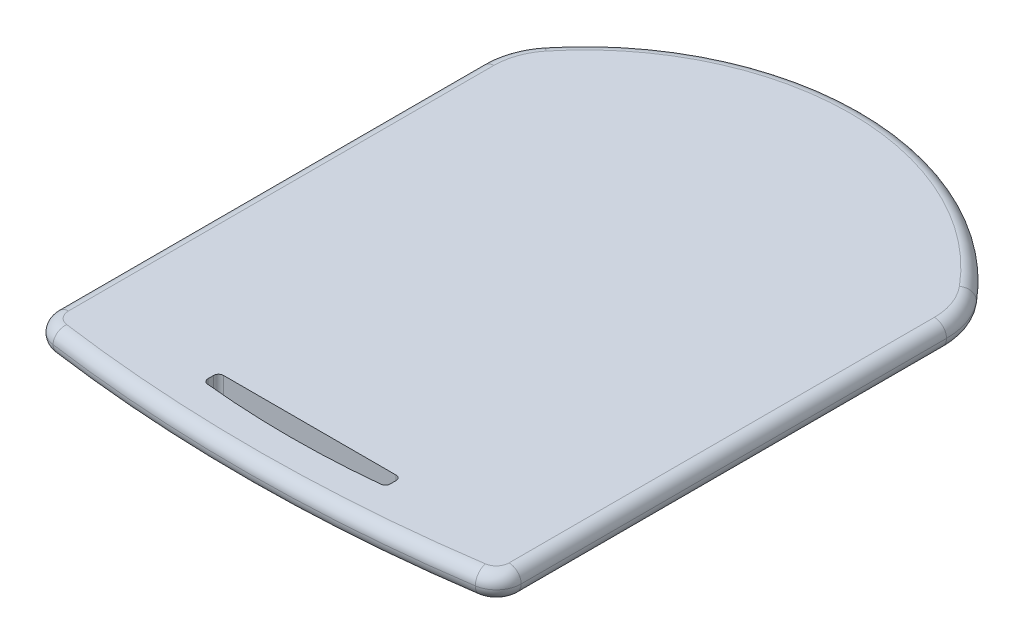
ISO-10303-21;
HEADER;
FILE_DESCRIPTION(('STEP AP214'),'2;1');
FILE_NAME('part.step','',(''),(''),'','','');
FILE_SCHEMA(('AUTOMOTIVE_DESIGN { 1 0 10303 214 1 1 1 1 }'));
ENDSEC;
DATA;
#1=APPLICATION_CONTEXT('core data for automotive mechanical design processes');
#2=APPLICATION_PROTOCOL_DEFINITION('international standard','automotive_design',2000,#1);
#3=PRODUCT_CONTEXT('',#1,'mechanical');
#4=PRODUCT('Part','Part','',(#3));
#5=PRODUCT_RELATED_PRODUCT_CATEGORY('part','',(#4));
#6=PRODUCT_DEFINITION_FORMATION('','',#4);
#7=PRODUCT_DEFINITION_CONTEXT('part definition',#1,'design');
#8=PRODUCT_DEFINITION('design','',#6,#7);
#9=PRODUCT_DEFINITION_SHAPE('','',#8);
#10=(LENGTH_UNIT() NAMED_UNIT(*) SI_UNIT(.MILLI.,.METRE.));
#11=(NAMED_UNIT(*) PLANE_ANGLE_UNIT() SI_UNIT($,.RADIAN.));
#12=(NAMED_UNIT(*) SI_UNIT($,.STERADIAN.) SOLID_ANGLE_UNIT());
#13=UNCERTAINTY_MEASURE_WITH_UNIT(LENGTH_MEASURE(1.E-05),#10,'distance_accuracy_value','');
#14=(GEOMETRIC_REPRESENTATION_CONTEXT(3) GLOBAL_UNCERTAINTY_ASSIGNED_CONTEXT((#13)) GLOBAL_UNIT_ASSIGNED_CONTEXT((#10,
#11,#12)) REPRESENTATION_CONTEXT('',''));
#15=CARTESIAN_POINT('',(0.,0.,0.));
#16=DIRECTION('',(0.,0.,1.));
#17=DIRECTION('',(1.,0.,0.));
#18=AXIS2_PLACEMENT_3D('',#15,#16,#17);
#19=CARTESIAN_POINT('',(84.8196952527564,10.,66.8932222649289));
#20=DIRECTION('',(0.,1.,0.));
#21=DIRECTION('',(0.,0.,1.));
#22=AXIS2_PLACEMENT_3D('',#19,#20,#21);
#23=PLANE('',#22);
#24=CARTESIAN_POINT('',(-3.23182190351051,10.,-527.331403190441));
#25=DIRECTION('',(0.,1.,0.));
#26=DIRECTION('',(0.,0.,1.));
#27=AXIS2_PLACEMENT_3D('',#24,#25,#26);
#28=CIRCLE('',#27,605.957669560178);
#29=CARTESIAN_POINT('',(-85.7928455469745,10.,72.9754972144648));
#30=VERTEX_POINT('',#29);
#31=CARTESIAN_POINT('',(85.5884666276943,10.,72.0813541346221));
#32=VERTEX_POINT('',#31);
#33=EDGE_CURVE('E252',#30,#32,#28,.T.);
#34=ORIENTED_EDGE('',*,*,#33,.T.);
#35=CARTESIAN_POINT('',(84.8196952527564,10.,66.8932222649289));
#36=DIRECTION('',(0.,1.,0.));
#37=DIRECTION('',(0.,0.,1.));
#38=AXIS2_PLACEMENT_3D('',#35,#36,#37);
#39=CIRCLE('',#38,5.24478042669569);
#40=CARTESIAN_POINT('',(90.064475679452,10.,66.8932224174004));
#41=VERTEX_POINT('',#40);
#42=EDGE_CURVE('E254',#32,#41,#39,.T.);
#43=ORIENTED_EDGE('',*,*,#42,.T.);
#44=DIRECTION('',(2.90710929138983E-08,0.,-1.));
#45=VECTOR('',#44,1.);
#46=CARTESIAN_POINT('',(90.0644807668933,10.,-108.1067775826));
#47=LINE('',#46,#45);
#48=CARTESIAN_POINT('',(90.0644807668933,10.,-108.1067775826));
#49=VERTEX_POINT('',#48);
#50=EDGE_CURVE('E240',#41,#49,#47,.T.);
#51=ORIENTED_EDGE('',*,*,#50,.T.);
#52=CARTESIAN_POINT('',(64.8496108397123,10.,-108.106778315624));
#53=DIRECTION('',(0.,1.,0.));
#54=DIRECTION('',(0.,0.,1.));
#55=AXIS2_PLACEMENT_3D('',#52,#53,#54);
#56=CIRCLE('',#55,25.214869927181);
#57=CARTESIAN_POINT('',(84.2043618560106,10.,-124.267944070041));
#58=VERTEX_POINT('',#57);
#59=EDGE_CURVE('E242',#49,#58,#56,.T.);
#60=ORIENTED_EDGE('',*,*,#59,.T.);
#61=CARTESIAN_POINT('',(0.235631741272779,10.,-54.1542771760837));
#62=DIRECTION('',(0.,1.,0.));
#63=DIRECTION('',(0.,0.,1.));
#64=AXIS2_PLACEMENT_3D('',#61,#62,#63);
#65=CIRCLE('',#64,109.392293706634);
#66=CARTESIAN_POINT('',(-84.681676564494,10.,-123.116039570195));
#67=VERTEX_POINT('',#66);
#68=EDGE_CURVE('E244',#58,#67,#65,.T.);
#69=ORIENTED_EDGE('',*,*,#68,.T.);
#70=CARTESIAN_POINT('',(-65.1082787414404,10.,-107.220387236769));
#71=DIRECTION('',(0.,1.,0.));
#72=DIRECTION('',(0.,0.,1.));
#73=AXIS2_PLACEMENT_3D('',#70,#71,#72);
#74=CIRCLE('',#73,25.2148699271814);
#75=CARTESIAN_POINT('',(-90.3231486686161,10.,-107.220370250178));
#76=VERTEX_POINT('',#75);
#77=EDGE_CURVE('E246',#67,#76,#74,.T.);
#78=ORIENTED_EDGE('',*,*,#77,.T.);
#79=DIRECTION('',(6.73673554163479E-07,0.,0.999999999999773));
#80=VECTOR('',#79,1.);
#81=CARTESIAN_POINT('',(-90.3230307757441,10.,67.7796297497826));
#82=LINE('',#81,#80);
#83=CARTESIAN_POINT('',(-90.3230307757441,10.,67.7796297497826));
#84=VERTEX_POINT('',#83);
#85=EDGE_CURVE('E248',#76,#84,#82,.T.);
#86=ORIENTED_EDGE('',*,*,#85,.T.);
#87=CARTESIAN_POINT('',(-85.0782503490483,10.,67.7796262165128));
#88=DIRECTION('',(0.,1.,0.));
#89=DIRECTION('',(0.,0.,1.));
#90=AXIS2_PLACEMENT_3D('',#87,#88,#89);
#91=CIRCLE('',#90,5.24478042669643);
#92=EDGE_CURVE('E250',#84,#30,#91,.T.);
#93=ORIENTED_EDGE('',*,*,#92,.T.);
#94=EDGE_LOOP('',(#34,#43,#51,#60,#69,#78,#86,#93));
#95=FACE_BOUND('',#94,.T.);
#96=DIRECTION('',(-1.,0.,0.));
#97=VECTOR('',#96,1.);
#98=CARTESIAN_POINT('',(35.5,10.,58.8214409386156));
#99=LINE('',#98,#97);
#100=CARTESIAN_POINT('',(35.5,10.,58.8214409386156));
#101=VERTEX_POINT('',#100);
#102=CARTESIAN_POINT('',(-35.5,10.,58.8214409386156));
#103=VERTEX_POINT('',#102);
#104=EDGE_CURVE('E591',#101,#103,#99,.T.);
#105=ORIENTED_EDGE('',*,*,#104,.F.);
#106=CARTESIAN_POINT('',(35.5,10.,60.8214409386156));
#107=DIRECTION('',(0.,1.,0.));
#108=DIRECTION('',(0.,0.,-1.));
#109=AXIS2_PLACEMENT_3D('',#106,#107,#108);
#110=CIRCLE('',#109,2.);
#111=CARTESIAN_POINT('',(37.5,10.,60.8214409386156));
#112=VERTEX_POINT('',#111);
#113=EDGE_CURVE('E222',#112,#101,#110,.T.);
#114=ORIENTED_EDGE('',*,*,#113,.F.);
#115=DIRECTION('',(0.,0.,-1.));
#116=VECTOR('',#115,1.);
#117=CARTESIAN_POINT('',(37.5,10.,63.2220084632309));
#118=LINE('',#117,#116);
#119=CARTESIAN_POINT('',(37.5,10.,63.2220084632309));
#120=VERTEX_POINT('',#119);
#121=EDGE_CURVE('E203',#120,#112,#118,.T.);
#122=ORIENTED_EDGE('',*,*,#121,.F.);
#123=CARTESIAN_POINT('',(35.5,10.,63.2220084632309));
#124=DIRECTION('',(0.,1.,0.));
#125=DIRECTION('',(0.,0.,-1.));
#126=AXIS2_PLACEMENT_3D('',#123,#124,#125);
#127=CIRCLE('',#126,2.00000000000001);
#128=CARTESIAN_POINT('',(35.7050934018111,10.,65.2114648453951));
#129=VERTEX_POINT('',#128);
#130=EDGE_CURVE('E585',#129,#120,#127,.T.);
#131=ORIENTED_EDGE('',*,*,#130,.F.);
#132=CARTESIAN_POINT('',(0.,10.,-281.136712700921));
#133=DIRECTION('',(0.,1.,0.));
#134=DIRECTION('',(0.,0.,1.));
#135=AXIS2_PLACEMENT_3D('',#132,#133,#134);
#136=CIRCLE('',#135,348.183735669096);
#137=CARTESIAN_POINT('',(-35.705093401811,10.,65.2114648453951));
#138=VERTEX_POINT('',#137);
#139=EDGE_CURVE('E587',#138,#129,#136,.T.);
#140=ORIENTED_EDGE('',*,*,#139,.F.);
#141=CARTESIAN_POINT('',(-35.5,10.,63.2220084632309));
#142=DIRECTION('',(0.,1.,0.));
#143=DIRECTION('',(0.,0.,1.));
#144=AXIS2_PLACEMENT_3D('',#141,#142,#143);
#145=CIRCLE('',#144,2.00000000000001);
#146=CARTESIAN_POINT('',(-37.5,10.,63.2220084632309));
#147=VERTEX_POINT('',#146);
#148=EDGE_CURVE('E601',#147,#138,#145,.T.);
#149=ORIENTED_EDGE('',*,*,#148,.F.);
#150=DIRECTION('',(0.,0.,1.));
#151=VECTOR('',#150,1.);
#152=CARTESIAN_POINT('',(-37.5,10.,63.2220084632309));
#153=LINE('',#152,#151);
#154=CARTESIAN_POINT('',(-37.5,10.,60.8214409386156));
#155=VERTEX_POINT('',#154);
#156=EDGE_CURVE('E598',#155,#147,#153,.T.);
#157=ORIENTED_EDGE('',*,*,#156,.F.);
#158=CARTESIAN_POINT('',(-35.5,10.,60.8214409386156));
#159=DIRECTION('',(0.,1.,0.));
#160=DIRECTION('',(0.,0.,1.));
#161=AXIS2_PLACEMENT_3D('',#158,#159,#160);
#162=CIRCLE('',#161,2.);
#163=EDGE_CURVE('E593',#103,#155,#162,.T.);
#164=ORIENTED_EDGE('',*,*,#163,.F.);
#165=EDGE_LOOP('',(#105,#114,#122,#131,#140,#149,#157,#164));
#166=FACE_BOUND('',#165,.T.);
#167=ADVANCED_FACE('F35',(#95,#166),#23,.T.);
#168=CARTESIAN_POINT('',(84.8196952527564,0.,66.8932222649289));
#169=DIRECTION('',(0.,1.,0.));
#170=DIRECTION('',(0.,0.,1.));
#171=AXIS2_PLACEMENT_3D('',#168,#169,#170);
#172=PLANE('',#171);
#173=DIRECTION('',(2.90710929138983E-08,0.,-1.));
#174=VECTOR('',#173,1.);
#175=CARTESIAN_POINT('',(90.064475679452,0.,66.8932224174004));
#176=LINE('',#175,#174);
#177=CARTESIAN_POINT('',(90.0644807668933,0.,-108.1067775826));
#178=VERTEX_POINT('',#177);
#179=CARTESIAN_POINT('',(90.064475679452,0.,66.8932224174004));
#180=VERTEX_POINT('',#179);
#181=EDGE_CURVE('E257',#178,#180,#176,.F.);
#182=ORIENTED_EDGE('',*,*,#181,.T.);
#183=CARTESIAN_POINT('',(84.8196952527564,0.,66.8932222649289));
#184=DIRECTION('',(0.,1.,0.));
#185=DIRECTION('',(0.,0.,1.));
#186=AXIS2_PLACEMENT_3D('',#183,#184,#185);
#187=CIRCLE('',#186,5.24478042669569);
#188=CARTESIAN_POINT('',(85.5884666276943,0.,72.0813541346221));
#189=VERTEX_POINT('',#188);
#190=EDGE_CURVE('E11',#180,#189,#187,.F.);
#191=ORIENTED_EDGE('',*,*,#190,.T.);
#192=CARTESIAN_POINT('',(-3.23182190351051,0.,-527.331403190441));
#193=DIRECTION('',(0.,1.,0.));
#194=DIRECTION('',(0.,0.,1.));
#195=AXIS2_PLACEMENT_3D('',#192,#193,#194);
#196=CIRCLE('',#195,605.957669560178);
#197=CARTESIAN_POINT('',(-85.7928455469745,0.,72.9754972144648));
#198=VERTEX_POINT('',#197);
#199=EDGE_CURVE('E45',#189,#198,#196,.F.);
#200=ORIENTED_EDGE('',*,*,#199,.T.);
#201=CARTESIAN_POINT('',(-85.0782503490483,0.,67.7796262165128));
#202=DIRECTION('',(0.,1.,0.));
#203=DIRECTION('',(0.,0.,1.));
#204=AXIS2_PLACEMENT_3D('',#201,#202,#203);
#205=CIRCLE('',#204,5.24478042669643);
#206=CARTESIAN_POINT('',(-90.3230307757441,0.,67.7796297497826));
#207=VERTEX_POINT('',#206);
#208=EDGE_CURVE('E165',#198,#207,#205,.F.);
#209=ORIENTED_EDGE('',*,*,#208,.T.);
#210=DIRECTION('',(6.73673554163479E-07,0.,0.999999999999773));
#211=VECTOR('',#210,1.);
#212=CARTESIAN_POINT('',(-90.3230313728139,0.,66.893340253952));
#213=LINE('',#212,#211);
#214=CARTESIAN_POINT('',(-90.3231486686161,0.,-107.220370250178));
#215=VERTEX_POINT('',#214);
#216=EDGE_CURVE('E169',#207,#215,#213,.F.);
#217=ORIENTED_EDGE('',*,*,#216,.T.);
#218=CARTESIAN_POINT('',(-65.1082787414404,0.,-107.220387236769));
#219=DIRECTION('',(0.,1.,0.));
#220=DIRECTION('',(0.,0.,1.));
#221=AXIS2_PLACEMENT_3D('',#218,#219,#220);
#222=CIRCLE('',#221,25.2148699271814);
#223=CARTESIAN_POINT('',(-84.681676564494,0.,-123.116039570195));
#224=VERTEX_POINT('',#223);
#225=EDGE_CURVE('E179',#215,#224,#222,.F.);
#226=ORIENTED_EDGE('',*,*,#225,.T.);
#227=CARTESIAN_POINT('',(0.235631741272779,0.,-54.1542771760837));
#228=DIRECTION('',(0.,1.,0.));
#229=DIRECTION('',(0.,0.,1.));
#230=AXIS2_PLACEMENT_3D('',#227,#228,#229);
#231=CIRCLE('',#230,109.392293706634);
#232=CARTESIAN_POINT('',(84.2043618560106,0.,-124.267944070041));
#233=VERTEX_POINT('',#232);
#234=EDGE_CURVE('E261',#224,#233,#231,.F.);
#235=ORIENTED_EDGE('',*,*,#234,.T.);
#236=CARTESIAN_POINT('',(64.8496108397123,0.,-108.106778315624));
#237=DIRECTION('',(0.,1.,0.));
#238=DIRECTION('',(0.,0.,1.));
#239=AXIS2_PLACEMENT_3D('',#236,#237,#238);
#240=CIRCLE('',#239,25.214869927181);
#241=EDGE_CURVE('E259',#233,#178,#240,.F.);
#242=ORIENTED_EDGE('',*,*,#241,.T.);
#243=EDGE_LOOP('',(#182,#191,#200,#209,#217,#226,#235,#242));
#244=FACE_BOUND('',#243,.T.);
#245=CARTESIAN_POINT('',(35.5,0.,60.8214409386156));
#246=DIRECTION('',(0.,1.,0.));
#247=DIRECTION('',(0.,0.,-1.));
#248=AXIS2_PLACEMENT_3D('',#245,#246,#247);
#249=CIRCLE('',#248,2.);
#250=CARTESIAN_POINT('',(37.5,0.,60.8214409386156));
#251=VERTEX_POINT('',#250);
#252=CARTESIAN_POINT('',(35.5,0.,58.8214409386156));
#253=VERTEX_POINT('',#252);
#254=EDGE_CURVE('E196',#251,#253,#249,.T.);
#255=ORIENTED_EDGE('',*,*,#254,.T.);
#256=DIRECTION('',(-1.,0.,0.));
#257=VECTOR('',#256,1.);
#258=CARTESIAN_POINT('',(35.5,0.,58.8214409386156));
#259=LINE('',#258,#257);
#260=CARTESIAN_POINT('',(-35.5,0.,58.8214409386156));
#261=VERTEX_POINT('',#260);
#262=EDGE_CURVE('E95',#253,#261,#259,.T.);
#263=ORIENTED_EDGE('',*,*,#262,.T.);
#264=CARTESIAN_POINT('',(-35.5,0.,60.8214409386156));
#265=DIRECTION('',(0.,1.,0.));
#266=DIRECTION('',(0.,0.,1.));
#267=AXIS2_PLACEMENT_3D('',#264,#265,#266);
#268=CIRCLE('',#267,2.);
#269=CARTESIAN_POINT('',(-37.5,0.,60.8214409386156));
#270=VERTEX_POINT('',#269);
#271=EDGE_CURVE('E200',#261,#270,#268,.T.);
#272=ORIENTED_EDGE('',*,*,#271,.T.);
#273=DIRECTION('',(0.,0.,1.));
#274=VECTOR('',#273,1.);
#275=CARTESIAN_POINT('',(-37.5,0.,63.2220084632309));
#276=LINE('',#275,#274);
#277=CARTESIAN_POINT('',(-37.5,0.,63.2220084632309));
#278=VERTEX_POINT('',#277);
#279=EDGE_CURVE('E208',#270,#278,#276,.T.);
#280=ORIENTED_EDGE('',*,*,#279,.T.);
#281=CARTESIAN_POINT('',(-35.5,0.,63.2220084632309));
#282=DIRECTION('',(0.,1.,0.));
#283=DIRECTION('',(0.,0.,1.));
#284=AXIS2_PLACEMENT_3D('',#281,#282,#283);
#285=CIRCLE('',#284,2.00000000000001);
#286=CARTESIAN_POINT('',(-35.705093401811,0.,65.2114648453951));
#287=VERTEX_POINT('',#286);
#288=EDGE_CURVE('E211',#278,#287,#285,.T.);
#289=ORIENTED_EDGE('',*,*,#288,.T.);
#290=CARTESIAN_POINT('',(0.,0.,-281.136712700921));
#291=DIRECTION('',(0.,1.,0.));
#292=DIRECTION('',(0.,0.,1.));
#293=AXIS2_PLACEMENT_3D('',#290,#291,#292);
#294=CIRCLE('',#293,348.183735669096);
#295=CARTESIAN_POINT('',(35.7050934018111,0.,65.2114648453951));
#296=VERTEX_POINT('',#295);
#297=EDGE_CURVE('E214',#287,#296,#294,.T.);
#298=ORIENTED_EDGE('',*,*,#297,.T.);
#299=CARTESIAN_POINT('',(35.5,0.,63.2220084632309));
#300=DIRECTION('',(0.,1.,0.));
#301=DIRECTION('',(0.,0.,-1.));
#302=AXIS2_PLACEMENT_3D('',#299,#300,#301);
#303=CIRCLE('',#302,2.00000000000001);
#304=CARTESIAN_POINT('',(37.5,0.,63.2220084632309));
#305=VERTEX_POINT('',#304);
#306=EDGE_CURVE('E217',#296,#305,#303,.T.);
#307=ORIENTED_EDGE('',*,*,#306,.T.);
#308=DIRECTION('',(0.,0.,-1.));
#309=VECTOR('',#308,1.);
#310=CARTESIAN_POINT('',(37.5,0.,63.2220084632309));
#311=LINE('',#310,#309);
#312=EDGE_CURVE('E220',#305,#251,#311,.T.);
#313=ORIENTED_EDGE('',*,*,#312,.T.);
#314=EDGE_LOOP('',(#255,#263,#272,#280,#289,#298,#307,#313));
#315=FACE_BOUND('',#314,.T.);
#316=ADVANCED_FACE('F167',(#244,#315),#172,.F.);
#317=CARTESIAN_POINT('',(35.5,10.,60.8214409386156));
#318=DIRECTION('',(0.,-1.,0.));
#319=DIRECTION('',(0.,0.,-1.));
#320=AXIS2_PLACEMENT_3D('',#317,#318,#319);
#321=CYLINDRICAL_SURFACE('',#320,2.);
#322=ORIENTED_EDGE('',*,*,#254,.F.);
#323=DIRECTION('',(0.,-1.,0.));
#324=VECTOR('',#323,1.);
#325=CARTESIAN_POINT('',(37.5,10.,60.8214409386156));
#326=LINE('',#325,#324);
#327=EDGE_CURVE('E223',#112,#251,#326,.T.);
#328=ORIENTED_EDGE('',*,*,#327,.F.);
#329=ORIENTED_EDGE('',*,*,#113,.T.);
#330=DIRECTION('',(0.,-1.,0.));
#331=VECTOR('',#330,1.);
#332=CARTESIAN_POINT('',(35.5,10.,58.8214409386156));
#333=LINE('',#332,#331);
#334=EDGE_CURVE('E238',#101,#253,#333,.T.);
#335=ORIENTED_EDGE('',*,*,#334,.T.);
#336=EDGE_LOOP('',(#322,#328,#329,#335));
#337=FACE_BOUND('',#336,.T.);
#338=ADVANCED_FACE('F346',(#337),#321,.F.);
#339=CARTESIAN_POINT('',(35.5,10.,58.8214409386156));
#340=DIRECTION('',(0.,0.,1.));
#341=DIRECTION('',(1.,0.,0.));
#342=AXIS2_PLACEMENT_3D('',#339,#340,#341);
#343=PLANE('',#342);
#344=ORIENTED_EDGE('',*,*,#262,.F.);
#345=ORIENTED_EDGE('',*,*,#334,.F.);
#346=ORIENTED_EDGE('',*,*,#104,.T.);
#347=DIRECTION('',(0.,-1.,0.));
#348=VECTOR('',#347,1.);
#349=CARTESIAN_POINT('',(-35.5,10.,58.8214409386156));
#350=LINE('',#349,#348);
#351=EDGE_CURVE('E236',#103,#261,#350,.T.);
#352=ORIENTED_EDGE('',*,*,#351,.T.);
#353=EDGE_LOOP('',(#344,#345,#346,#352));
#354=FACE_BOUND('',#353,.T.);
#355=ADVANCED_FACE('F537',(#354),#343,.T.);
#356=CARTESIAN_POINT('',(-35.5,10.,60.8214409386156));
#357=DIRECTION('',(0.,-1.,0.));
#358=DIRECTION('',(0.,0.,-1.));
#359=AXIS2_PLACEMENT_3D('',#356,#357,#358);
#360=CYLINDRICAL_SURFACE('',#359,2.);
#361=ORIENTED_EDGE('',*,*,#271,.F.);
#362=ORIENTED_EDGE('',*,*,#351,.F.);
#363=ORIENTED_EDGE('',*,*,#163,.T.);
#364=DIRECTION('',(0.,-1.,0.));
#365=VECTOR('',#364,1.);
#366=CARTESIAN_POINT('',(-37.5,10.,60.8214409386156));
#367=LINE('',#366,#365);
#368=EDGE_CURVE('E234',#155,#270,#367,.T.);
#369=ORIENTED_EDGE('',*,*,#368,.T.);
#370=EDGE_LOOP('',(#361,#362,#363,#369));
#371=FACE_BOUND('',#370,.T.);
#372=ADVANCED_FACE('F528',(#371),#360,.F.);
#373=CARTESIAN_POINT('',(-37.5,10.,63.2220084632309));
#374=DIRECTION('',(1.,0.,0.));
#375=DIRECTION('',(0.,0.,-1.));
#376=AXIS2_PLACEMENT_3D('',#373,#374,#375);
#377=PLANE('',#376);
#378=ORIENTED_EDGE('',*,*,#279,.F.);
#379=ORIENTED_EDGE('',*,*,#368,.F.);
#380=ORIENTED_EDGE('',*,*,#156,.T.);
#381=DIRECTION('',(0.,-1.,0.));
#382=VECTOR('',#381,1.);
#383=CARTESIAN_POINT('',(-37.5,10.,63.2220084632309));
#384=LINE('',#383,#382);
#385=EDGE_CURVE('E232',#147,#278,#384,.T.);
#386=ORIENTED_EDGE('',*,*,#385,.T.);
#387=EDGE_LOOP('',(#378,#379,#380,#386));
#388=FACE_BOUND('',#387,.T.);
#389=ADVANCED_FACE('F519',(#388),#377,.T.);
#390=CARTESIAN_POINT('',(-35.5,10.,63.2220084632309));
#391=DIRECTION('',(0.,-1.,0.));
#392=DIRECTION('',(0.,0.,-1.));
#393=AXIS2_PLACEMENT_3D('',#390,#391,#392);
#394=CYLINDRICAL_SURFACE('',#393,2.00000000000001);
#395=ORIENTED_EDGE('',*,*,#288,.F.);
#396=ORIENTED_EDGE('',*,*,#385,.F.);
#397=ORIENTED_EDGE('',*,*,#148,.T.);
#398=DIRECTION('',(0.,-1.,0.));
#399=VECTOR('',#398,1.);
#400=CARTESIAN_POINT('',(-35.705093401811,10.,65.2114648453951));
#401=LINE('',#400,#399);
#402=EDGE_CURVE('E230',#138,#287,#401,.T.);
#403=ORIENTED_EDGE('',*,*,#402,.T.);
#404=EDGE_LOOP('',(#395,#396,#397,#403));
#405=FACE_BOUND('',#404,.T.);
#406=ADVANCED_FACE('F510',(#405),#394,.F.);
#407=CARTESIAN_POINT('',(0.,10.,-281.136712700921));
#408=DIRECTION('',(0.,-1.,0.));
#409=DIRECTION('',(0.,0.,-1.));
#410=AXIS2_PLACEMENT_3D('',#407,#408,#409);
#411=CYLINDRICAL_SURFACE('',#410,348.183735669096);
#412=ORIENTED_EDGE('',*,*,#297,.F.);
#413=ORIENTED_EDGE('',*,*,#402,.F.);
#414=ORIENTED_EDGE('',*,*,#139,.T.);
#415=DIRECTION('',(0.,-1.,0.));
#416=VECTOR('',#415,1.);
#417=CARTESIAN_POINT('',(35.7050934018111,10.,65.2114648453951));
#418=LINE('',#417,#416);
#419=EDGE_CURVE('E228',#129,#296,#418,.T.);
#420=ORIENTED_EDGE('',*,*,#419,.T.);
#421=EDGE_LOOP('',(#412,#413,#414,#420));
#422=FACE_BOUND('',#421,.T.);
#423=ADVANCED_FACE('F501',(#422),#411,.F.);
#424=CARTESIAN_POINT('',(35.5,10.,63.2220084632309));
#425=DIRECTION('',(0.,-1.,0.));
#426=DIRECTION('',(0.,0.,-1.));
#427=AXIS2_PLACEMENT_3D('',#424,#425,#426);
#428=CYLINDRICAL_SURFACE('',#427,2.00000000000001);
#429=ORIENTED_EDGE('',*,*,#306,.F.);
#430=ORIENTED_EDGE('',*,*,#419,.F.);
#431=ORIENTED_EDGE('',*,*,#130,.T.);
#432=DIRECTION('',(0.,-1.,0.));
#433=VECTOR('',#432,1.);
#434=CARTESIAN_POINT('',(37.5,10.,63.2220084632309));
#435=LINE('',#434,#433);
#436=EDGE_CURVE('E226',#120,#305,#435,.T.);
#437=ORIENTED_EDGE('',*,*,#436,.T.);
#438=EDGE_LOOP('',(#429,#430,#431,#437));
#439=FACE_BOUND('',#438,.T.);
#440=ADVANCED_FACE('F338',(#439),#428,.F.);
#441=CARTESIAN_POINT('',(37.5,10.,63.2220084632309));
#442=DIRECTION('',(-1.,0.,0.));
#443=DIRECTION('',(0.,0.,1.));
#444=AXIS2_PLACEMENT_3D('',#441,#442,#443);
#445=PLANE('',#444);
#446=ORIENTED_EDGE('',*,*,#312,.F.);
#447=ORIENTED_EDGE('',*,*,#436,.F.);
#448=ORIENTED_EDGE('',*,*,#121,.T.);
#449=ORIENTED_EDGE('',*,*,#327,.T.);
#450=EDGE_LOOP('',(#446,#447,#448,#449));
#451=FACE_BOUND('',#450,.T.);
#452=ADVANCED_FACE('F333',(#451),#445,.T.);
#453=CARTESIAN_POINT('',(-65.1082787414404,5.,-107.220387236769));
#454=DIRECTION('',(0.,1.,0.));
#455=DIRECTION('',(0.,0.,1.));
#456=AXIS2_PLACEMENT_3D('',#453,#454,#455);
#457=TOROIDAL_SURFACE('',#456,25.2148699271814,5.);
#458=CARTESIAN_POINT('',(-84.681676564494,5.,-123.116039570195));
#459=DIRECTION('',(0.630407865649579,0.,-0.776264080662723));
#460=DIRECTION('',(-0.776264080662723,0.,-0.630407865649579));
#461=AXIS2_PLACEMENT_3D('',#458,#459,#460);
#462=CIRCLE('',#461,5.);
#463=CARTESIAN_POINT('',(-88.5629969678076,5.,-126.268078898443));
#464=VERTEX_POINT('',#463);
#465=EDGE_CURVE('E186',#224,#464,#462,.T.);
#466=ORIENTED_EDGE('',*,*,#465,.F.);
#467=ORIENTED_EDGE('',*,*,#225,.F.);
#468=CARTESIAN_POINT('',(-90.3231486686161,5.,-107.220370250178));
#469=DIRECTION('',(6.73673553053255E-07,0.,0.999999999999773));
#470=DIRECTION('',(0.999999999999773,0.,-6.73673553053255E-07));
#471=AXIS2_PLACEMENT_3D('',#468,#469,#470);
#472=CIRCLE('',#471,5.);
#473=CARTESIAN_POINT('',(-95.3231486686149,5.,-107.22036688181));
#474=VERTEX_POINT('',#473);
#475=EDGE_CURVE('E39',#474,#215,#472,.T.);
#476=ORIENTED_EDGE('',*,*,#475,.F.);
#477=CARTESIAN_POINT('',(-65.1082787414404,5.,-107.220387236769));
#478=DIRECTION('',(0.,1.,0.));
#479=DIRECTION('',(0.,0.,1.));
#480=AXIS2_PLACEMENT_3D('',#477,#478,#479);
#481=CIRCLE('',#480,30.2148699271814);
#482=EDGE_CURVE('E83',#464,#474,#481,.T.);
#483=ORIENTED_EDGE('',*,*,#482,.F.);
#484=EDGE_LOOP('',(#466,#467,#476,#483));
#485=FACE_BOUND('',#484,.T.);
#486=ADVANCED_FACE('F37',(#485),#457,.T.);
#487=CARTESIAN_POINT('',(-90.3230307757441,5.,67.7796297497826));
#488=DIRECTION('',(6.73673554163479E-07,0.,0.999999999999773));
#489=DIRECTION('',(0.999999999999773,0.,-6.73673554163479E-07));
#490=AXIS2_PLACEMENT_3D('',#487,#488,#489);
#491=CYLINDRICAL_SURFACE('',#490,5.);
#492=ORIENTED_EDGE('',*,*,#475,.T.);
#493=ORIENTED_EDGE('',*,*,#216,.F.);
#494=CARTESIAN_POINT('',(-90.3230307757441,5.,67.7796297497826));
#495=DIRECTION('',(6.73673553053255E-07,0.,0.999999999999773));
#496=DIRECTION('',(0.999999999999773,0.,-6.73673553053255E-07));
#497=AXIS2_PLACEMENT_3D('',#494,#495,#496);
#498=CIRCLE('',#497,5.);
#499=CARTESIAN_POINT('',(-95.3230307757424,5.,67.7796331181504));
#500=VERTEX_POINT('',#499);
#501=EDGE_CURVE('E177',#500,#207,#498,.T.);
#502=ORIENTED_EDGE('',*,*,#501,.F.);
#503=DIRECTION('',(6.73673554163479E-07,0.,0.999999999999773));
#504=VECTOR('',#503,1.);
#505=CARTESIAN_POINT('',(-95.323030775743,5.,67.7796331181504));
#506=LINE('',#505,#504);
#507=EDGE_CURVE('E187',#474,#500,#506,.T.);
#508=ORIENTED_EDGE('',*,*,#507,.F.);
#509=EDGE_LOOP('',(#492,#493,#502,#508));
#510=FACE_BOUND('',#509,.T.);
#511=ADVANCED_FACE('F175',(#510),#491,.T.);
#512=CARTESIAN_POINT('',(-65.1082787414404,5.,-107.220387236769));
#513=DIRECTION('',(0.,1.,0.));
#514=DIRECTION('',(0.,0.,1.));
#515=AXIS2_PLACEMENT_3D('',#512,#513,#514);
#516=TOROIDAL_SURFACE('',#515,25.2148699271814,5.);
#517=CARTESIAN_POINT('',(-84.681676564494,5.,-123.116039570195));
#518=DIRECTION('',(0.630407865649579,0.,-0.776264080662723));
#519=DIRECTION('',(-0.776264080662723,0.,-0.630407865649579));
#520=AXIS2_PLACEMENT_3D('',#517,#518,#519);
#521=CIRCLE('',#520,5.);
#522=EDGE_CURVE('E308',#464,#67,#521,.T.);
#523=ORIENTED_EDGE('',*,*,#522,.F.);
#524=ORIENTED_EDGE('',*,*,#482,.T.);
#525=CARTESIAN_POINT('',(-90.3231486686161,5.,-107.220370250178));
#526=DIRECTION('',(6.73673553053255E-07,0.,0.999999999999773));
#527=DIRECTION('',(0.999999999999773,0.,-6.73673553053255E-07));
#528=AXIS2_PLACEMENT_3D('',#525,#526,#527);
#529=CIRCLE('',#528,5.);
#530=EDGE_CURVE('E190',#76,#474,#529,.T.);
#531=ORIENTED_EDGE('',*,*,#530,.F.);
#532=ORIENTED_EDGE('',*,*,#77,.F.);
#533=EDGE_LOOP('',(#523,#524,#531,#532));
#534=FACE_BOUND('',#533,.T.);
#535=ADVANCED_FACE('F316',(#534),#516,.T.);
#536=CARTESIAN_POINT('',(0.235631741272779,5.,-54.1542771760837));
#537=DIRECTION('',(0.,1.,0.));
#538=DIRECTION('',(0.,0.,1.));
#539=AXIS2_PLACEMENT_3D('',#536,#537,#538);
#540=TOROIDAL_SURFACE('',#539,109.392293706634,5.);
#541=ORIENTED_EDGE('',*,*,#234,.F.);
#542=ORIENTED_EDGE('',*,*,#465,.T.);
#543=CARTESIAN_POINT('',(0.235631741272779,5.,-54.1542771760837));
#544=DIRECTION('',(0.,1.,0.));
#545=DIRECTION('',(0.,0.,1.));
#546=AXIS2_PLACEMENT_3D('',#543,#544,#545);
#547=CIRCLE('',#546,114.392293706634);
#548=CARTESIAN_POINT('',(88.0423255401767,5.,-127.472633564988));
#549=VERTEX_POINT('',#548);
#550=EDGE_CURVE('E305',#549,#464,#547,.T.);
#551=ORIENTED_EDGE('',*,*,#550,.F.);
#552=CARTESIAN_POINT('',(84.2043618560106,5.,-124.267944070041));
#553=DIRECTION('',(0.640937898989364,0.,0.767592736833212));
#554=DIRECTION('',(0.767592736833212,0.,-0.640937898989364));
#555=AXIS2_PLACEMENT_3D('',#552,#553,#554);
#556=CIRCLE('',#555,5.);
#557=EDGE_CURVE('E302',#233,#549,#556,.T.);
#558=ORIENTED_EDGE('',*,*,#557,.F.);
#559=EDGE_LOOP('',(#541,#542,#551,#558));
#560=FACE_BOUND('',#559,.T.);
#561=ADVANCED_FACE('F325',(#560),#540,.T.);
#562=CARTESIAN_POINT('',(-85.0782503490483,5.,67.7796262165128));
#563=DIRECTION('',(0.,1.,0.));
#564=DIRECTION('',(0.,0.,1.));
#565=AXIS2_PLACEMENT_3D('',#562,#563,#564);
#566=TOROIDAL_SURFACE('',#565,5.24478042669643,5.);
#567=ORIENTED_EDGE('',*,*,#501,.T.);
#568=ORIENTED_EDGE('',*,*,#208,.F.);
#569=CARTESIAN_POINT('',(-85.7928455469736,5.,72.9754972144649));
#570=DIRECTION('',(0.990674647027098,-1.65256127716563E-13,0.136248830225197));
#571=DIRECTION('',(0.136248830225197,0.,-0.990674647027098));
#572=AXIS2_PLACEMENT_3D('',#569,#570,#571);
#573=CIRCLE('',#572,5.);
#574=CARTESIAN_POINT('',(-86.4740896980996,5.,77.9288704495998));
#575=VERTEX_POINT('',#574);
#576=EDGE_CURVE('E300',#575,#198,#573,.T.);
#577=ORIENTED_EDGE('',*,*,#576,.F.);
#578=CARTESIAN_POINT('',(-85.0782503490483,5.,67.7796262165128));
#579=DIRECTION('',(0.,1.,0.));
#580=DIRECTION('',(0.,0.,1.));
#581=AXIS2_PLACEMENT_3D('',#578,#579,#580);
#582=CIRCLE('',#581,10.2447804266964);
#583=EDGE_CURVE('E184',#500,#575,#582,.T.);
#584=ORIENTED_EDGE('',*,*,#583,.F.);
#585=EDGE_LOOP('',(#567,#568,#577,#584));
#586=FACE_BOUND('',#585,.T.);
#587=ADVANCED_FACE('F182',(#586),#566,.T.);
#588=CARTESIAN_POINT('',(-90.3230313728139,5.,66.893340253952));
#589=DIRECTION('',(-6.73673554163479E-07,0.,-0.999999999999773));
#590=DIRECTION('',(-0.999999999999773,0.,6.73673554163479E-07));
#591=AXIS2_PLACEMENT_3D('',#588,#589,#590);
#592=CYLINDRICAL_SURFACE('',#591,5.);
#593=ORIENTED_EDGE('',*,*,#530,.T.);
#594=ORIENTED_EDGE('',*,*,#507,.T.);
#595=CARTESIAN_POINT('',(-90.3230307757441,5.,67.7796297497826));
#596=DIRECTION('',(6.73673553053254E-07,0.,0.999999999999773));
#597=DIRECTION('',(0.999999999999773,0.,-6.73673553053254E-07));
#598=AXIS2_PLACEMENT_3D('',#595,#596,#597);
#599=CIRCLE('',#598,5.);
#600=EDGE_CURVE('E297',#84,#500,#599,.T.);
#601=ORIENTED_EDGE('',*,*,#600,.F.);
#602=ORIENTED_EDGE('',*,*,#85,.F.);
#603=EDGE_LOOP('',(#593,#594,#601,#602));
#604=FACE_BOUND('',#603,.T.);
#605=ADVANCED_FACE('F313',(#604),#592,.T.);
#606=CARTESIAN_POINT('',(0.235631741272779,5.,-54.1542771760837));
#607=DIRECTION('',(0.,1.,0.));
#608=DIRECTION('',(0.,0.,1.));
#609=AXIS2_PLACEMENT_3D('',#606,#607,#608);
#610=TOROIDAL_SURFACE('',#609,109.392293706634,5.);
#611=ORIENTED_EDGE('',*,*,#522,.T.);
#612=ORIENTED_EDGE('',*,*,#68,.F.);
#613=CARTESIAN_POINT('',(84.2043618560106,5.,-124.267944070041));
#614=DIRECTION('',(0.640937898989364,0.,0.767592736833212));
#615=DIRECTION('',(0.767592736833212,0.,-0.640937898989364));
#616=AXIS2_PLACEMENT_3D('',#613,#614,#615);
#617=CIRCLE('',#616,5.);
#618=EDGE_CURVE('E294',#549,#58,#617,.T.);
#619=ORIENTED_EDGE('',*,*,#618,.F.);
#620=ORIENTED_EDGE('',*,*,#550,.T.);
#621=EDGE_LOOP('',(#611,#612,#619,#620));
#622=FACE_BOUND('',#621,.T.);
#623=ADVANCED_FACE('F320',(#622),#610,.T.);
#624=CARTESIAN_POINT('',(64.8496108397123,5.,-108.106778315624));
#625=DIRECTION('',(0.,1.,0.));
#626=DIRECTION('',(0.,0.,1.));
#627=AXIS2_PLACEMENT_3D('',#624,#625,#626);
#628=TOROIDAL_SURFACE('',#627,25.214869927181,5.);
#629=ORIENTED_EDGE('',*,*,#241,.F.);
#630=ORIENTED_EDGE('',*,*,#557,.T.);
#631=CARTESIAN_POINT('',(64.8496108397123,5.,-108.106778315624));
#632=DIRECTION('',(0.,1.,0.));
#633=DIRECTION('',(0.,0.,1.));
#634=AXIS2_PLACEMENT_3D('',#631,#632,#633);
#635=CIRCLE('',#634,30.214869927181);
#636=CARTESIAN_POINT('',(95.0644807668933,5.,-108.106777437244));
#637=VERTEX_POINT('',#636);
#638=EDGE_CURVE('E291',#637,#549,#635,.T.);
#639=ORIENTED_EDGE('',*,*,#638,.F.);
#640=CARTESIAN_POINT('',(90.0644807668933,5.,-108.1067775826));
#641=DIRECTION('',(-2.90710927552951E-08,0.,1.));
#642=DIRECTION('',(1.,0.,2.90710927552951E-08));
#643=AXIS2_PLACEMENT_3D('',#640,#641,#642);
#644=CIRCLE('',#643,5.);
#645=EDGE_CURVE('E288',#178,#637,#644,.T.);
#646=ORIENTED_EDGE('',*,*,#645,.F.);
#647=EDGE_LOOP('',(#629,#630,#639,#646));
#648=FACE_BOUND('',#647,.T.);
#649=ADVANCED_FACE('F328',(#648),#628,.T.);
#650=CARTESIAN_POINT('',(-3.23182190351051,5.,-527.331403190441));
#651=DIRECTION('',(0.,1.,0.));
#652=DIRECTION('',(0.,0.,1.));
#653=AXIS2_PLACEMENT_3D('',#650,#651,#652);
#654=TOROIDAL_SURFACE('',#653,605.957669560178,5.);
#655=ORIENTED_EDGE('',*,*,#576,.T.);
#656=ORIENTED_EDGE('',*,*,#199,.F.);
#657=CARTESIAN_POINT('',(85.5884666276944,5.,72.081354134622));
#658=DIRECTION('',(0.989199060324024,0.,-0.146578371713116));
#659=DIRECTION('',(-0.146578371713116,0.,-0.989199060324024));
#660=AXIS2_PLACEMENT_3D('',#657,#658,#659);
#661=CIRCLE('',#660,5.);
#662=CARTESIAN_POINT('',(86.3213584862599,5.,77.0273494362422));
#663=VERTEX_POINT('',#662);
#664=EDGE_CURVE('E54',#663,#189,#661,.T.);
#665=ORIENTED_EDGE('',*,*,#664,.F.);
#666=CARTESIAN_POINT('',(-3.23182190351051,5.,-527.331403190441));
#667=DIRECTION('',(0.,1.,0.));
#668=DIRECTION('',(0.,0.,1.));
#669=AXIS2_PLACEMENT_3D('',#666,#667,#668);
#670=CIRCLE('',#669,610.957669560178);
#671=EDGE_CURVE('E282',#575,#663,#670,.T.);
#672=ORIENTED_EDGE('',*,*,#671,.F.);
#673=EDGE_LOOP('',(#655,#656,#665,#672));
#674=FACE_BOUND('',#673,.T.);
#675=ADVANCED_FACE('F378',(#674),#654,.T.);
#676=CARTESIAN_POINT('',(-85.0782503490483,5.,67.7796262165128));
#677=DIRECTION('',(0.,1.,0.));
#678=DIRECTION('',(0.,0.,1.));
#679=AXIS2_PLACEMENT_3D('',#676,#677,#678);
#680=TOROIDAL_SURFACE('',#679,5.24478042669643,5.);
#681=ORIENTED_EDGE('',*,*,#600,.T.);
#682=ORIENTED_EDGE('',*,*,#583,.T.);
#683=CARTESIAN_POINT('',(-85.7928455469745,5.,72.9754972144648));
#684=DIRECTION('',(0.99067464702712,0.,0.136248830225033));
#685=DIRECTION('',(0.136248830225033,0.,-0.990674647027121));
#686=AXIS2_PLACEMENT_3D('',#683,#684,#685);
#687=CIRCLE('',#686,5.);
#688=EDGE_CURVE('E279',#30,#575,#687,.T.);
#689=ORIENTED_EDGE('',*,*,#688,.F.);
#690=ORIENTED_EDGE('',*,*,#92,.F.);
#691=EDGE_LOOP('',(#681,#682,#689,#690));
#692=FACE_BOUND('',#691,.T.);
#693=ADVANCED_FACE('F374',(#692),#680,.T.);
#694=CARTESIAN_POINT('',(64.8496108397123,5.,-108.106778315624));
#695=DIRECTION('',(0.,1.,0.));
#696=DIRECTION('',(0.,0.,1.));
#697=AXIS2_PLACEMENT_3D('',#694,#695,#696);
#698=TOROIDAL_SURFACE('',#697,25.214869927181,5.);
#699=ORIENTED_EDGE('',*,*,#618,.T.);
#700=ORIENTED_EDGE('',*,*,#59,.F.);
#701=CARTESIAN_POINT('',(90.0644807668933,5.,-108.1067775826));
#702=DIRECTION('',(-2.9071092755295E-08,0.,1.));
#703=DIRECTION('',(1.,0.,2.9071092755295E-08));
#704=AXIS2_PLACEMENT_3D('',#701,#702,#703);
#705=CIRCLE('',#704,5.);
#706=EDGE_CURVE('E276',#637,#49,#705,.T.);
#707=ORIENTED_EDGE('',*,*,#706,.F.);
#708=ORIENTED_EDGE('',*,*,#638,.T.);
#709=EDGE_LOOP('',(#699,#700,#707,#708));
#710=FACE_BOUND('',#709,.T.);
#711=ADVANCED_FACE('F370',(#710),#698,.T.);
#712=CARTESIAN_POINT('',(90.064475679452,5.,66.8932224174004));
#713=DIRECTION('',(2.90710929138983E-08,0.,-1.));
#714=DIRECTION('',(-1.,0.,-2.90710929138983E-08));
#715=AXIS2_PLACEMENT_3D('',#712,#713,#714);
#716=CYLINDRICAL_SURFACE('',#715,5.);
#717=CARTESIAN_POINT('',(90.064475679452,5.,66.8932224174004));
#718=DIRECTION('',(-2.9071092755295E-08,0.,1.));
#719=DIRECTION('',(1.,0.,2.9071092755295E-08));
#720=AXIS2_PLACEMENT_3D('',#717,#718,#719);
#721=CIRCLE('',#720,5.);
#722=CARTESIAN_POINT('',(95.0644756794521,5.,66.8932225627558));
#723=VERTEX_POINT('',#722);
#724=EDGE_CURVE('E286',#180,#723,#721,.T.);
#725=ORIENTED_EDGE('',*,*,#724,.F.);
#726=ORIENTED_EDGE('',*,*,#181,.F.);
#727=ORIENTED_EDGE('',*,*,#645,.T.);
#728=DIRECTION('',(2.90710929138983E-08,0.,-1.));
#729=VECTOR('',#728,1.);
#730=CARTESIAN_POINT('',(95.064475679452,5.,66.8932225627558));
#731=LINE('',#730,#729);
#732=EDGE_CURVE('E273',#723,#637,#731,.T.);
#733=ORIENTED_EDGE('',*,*,#732,.F.);
#734=EDGE_LOOP('',(#725,#726,#727,#733));
#735=FACE_BOUND('',#734,.T.);
#736=ADVANCED_FACE('F367',(#735),#716,.T.);
#737=CARTESIAN_POINT('',(84.8196952527564,5.,66.8932222649289));
#738=DIRECTION('',(0.,1.,0.));
#739=DIRECTION('',(0.,0.,1.));
#740=AXIS2_PLACEMENT_3D('',#737,#738,#739);
#741=TOROIDAL_SURFACE('',#740,5.24478042669569,5.);
#742=ORIENTED_EDGE('',*,*,#190,.F.);
#743=ORIENTED_EDGE('',*,*,#724,.T.);
#744=CARTESIAN_POINT('',(84.8196952527564,5.,66.8932222649289));
#745=DIRECTION('',(0.,1.,0.));
#746=DIRECTION('',(0.,0.,1.));
#747=AXIS2_PLACEMENT_3D('',#744,#745,#746);
#748=CIRCLE('',#747,10.2447804266957);
#749=EDGE_CURVE('E270',#663,#723,#748,.T.);
#750=ORIENTED_EDGE('',*,*,#749,.F.);
#751=ORIENTED_EDGE('',*,*,#664,.T.);
#752=EDGE_LOOP('',(#742,#743,#750,#751));
#753=FACE_BOUND('',#752,.T.);
#754=ADVANCED_FACE('F363',(#753),#741,.T.);
#755=CARTESIAN_POINT('',(-3.23182190351051,5.,-527.331403190441));
#756=DIRECTION('',(0.,1.,0.));
#757=DIRECTION('',(0.,0.,1.));
#758=AXIS2_PLACEMENT_3D('',#755,#756,#757);
#759=TOROIDAL_SURFACE('',#758,605.957669560178,5.);
#760=ORIENTED_EDGE('',*,*,#688,.T.);
#761=ORIENTED_EDGE('',*,*,#671,.T.);
#762=CARTESIAN_POINT('',(85.5884666276943,5.,72.0813541346221));
#763=DIRECTION('',(0.989199060324023,0.,-0.146578371713121));
#764=DIRECTION('',(-0.146578371713121,0.,-0.989199060324023));
#765=AXIS2_PLACEMENT_3D('',#762,#763,#764);
#766=CIRCLE('',#765,5.);
#767=EDGE_CURVE('E267',#32,#663,#766,.T.);
#768=ORIENTED_EDGE('',*,*,#767,.F.);
#769=ORIENTED_EDGE('',*,*,#33,.F.);
#770=EDGE_LOOP('',(#760,#761,#768,#769));
#771=FACE_BOUND('',#770,.T.);
#772=ADVANCED_FACE('F359',(#771),#759,.T.);
#773=CARTESIAN_POINT('',(90.064475679452,5.,66.8932224174004));
#774=DIRECTION('',(-2.90710929138983E-08,0.,1.));
#775=DIRECTION('',(1.,0.,2.90710929138983E-08));
#776=AXIS2_PLACEMENT_3D('',#773,#774,#775);
#777=CYLINDRICAL_SURFACE('',#776,5.);
#778=ORIENTED_EDGE('',*,*,#706,.T.);
#779=ORIENTED_EDGE('',*,*,#50,.F.);
#780=CARTESIAN_POINT('',(90.064475679452,5.,66.8932224174004));
#781=DIRECTION('',(-2.9071092755295E-08,0.,1.));
#782=DIRECTION('',(1.,0.,2.9071092755295E-08));
#783=AXIS2_PLACEMENT_3D('',#780,#781,#782);
#784=CIRCLE('',#783,5.);
#785=EDGE_CURVE('E265',#723,#41,#784,.T.);
#786=ORIENTED_EDGE('',*,*,#785,.F.);
#787=ORIENTED_EDGE('',*,*,#732,.T.);
#788=EDGE_LOOP('',(#778,#779,#786,#787));
#789=FACE_BOUND('',#788,.T.);
#790=ADVANCED_FACE('F355',(#789),#777,.T.);
#791=CARTESIAN_POINT('',(84.8196952527564,5.,66.8932222649289));
#792=DIRECTION('',(0.,1.,0.));
#793=DIRECTION('',(0.,0.,1.));
#794=AXIS2_PLACEMENT_3D('',#791,#792,#793);
#795=TOROIDAL_SURFACE('',#794,5.24478042669569,5.);
#796=ORIENTED_EDGE('',*,*,#767,.T.);
#797=ORIENTED_EDGE('',*,*,#749,.T.);
#798=ORIENTED_EDGE('',*,*,#785,.T.);
#799=ORIENTED_EDGE('',*,*,#42,.F.);
#800=EDGE_LOOP('',(#796,#797,#798,#799));
#801=FACE_BOUND('',#800,.T.);
#802=ADVANCED_FACE('F352',(#801),#795,.T.);
#803=CLOSED_SHELL('',(#167,#316,#338,#355,#372,#389,#406,#423,#440,#452,#486,#511,#535,#561,
#587,#605,#623,#649,#675,#693,#711,#736,#754,#772,#790,#802));
#804=MANIFOLD_SOLID_BREP('B2',#803);
#805=ADVANCED_BREP_SHAPE_REPRESENTATION('',(#18,#804),#14);
#806=SHAPE_DEFINITION_REPRESENTATION(#9,#805);
ENDSEC;
END-ISO-10303-21;
